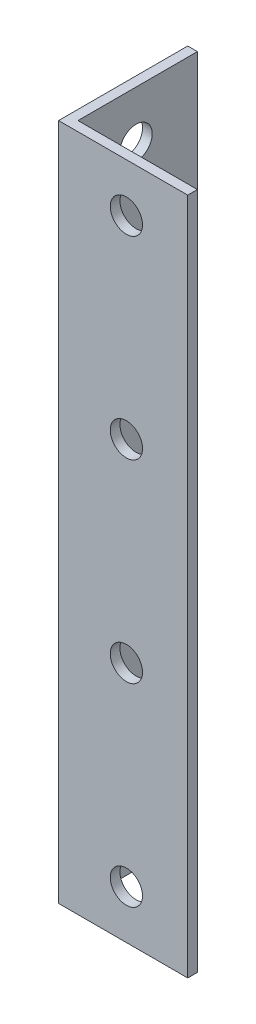
ISO-10303-21;
HEADER;
FILE_DESCRIPTION(('STEP AP214'),'2;1');
FILE_NAME('part.step','',(''),(''),'','','');
FILE_SCHEMA(('AUTOMOTIVE_DESIGN { 1 0 10303 214 1 1 1 1 }'));
ENDSEC;
DATA;
#1=APPLICATION_CONTEXT('core data for automotive mechanical design processes');
#2=APPLICATION_PROTOCOL_DEFINITION('international standard','automotive_design',2000,#1);
#3=PRODUCT_CONTEXT('',#1,'mechanical');
#4=PRODUCT('Part','Part','',(#3));
#5=PRODUCT_RELATED_PRODUCT_CATEGORY('part','',(#4));
#6=PRODUCT_DEFINITION_FORMATION('','',#4);
#7=PRODUCT_DEFINITION_CONTEXT('part definition',#1,'design');
#8=PRODUCT_DEFINITION('design','',#6,#7);
#9=PRODUCT_DEFINITION_SHAPE('','',#8);
#10=(LENGTH_UNIT() NAMED_UNIT(*) SI_UNIT(.MILLI.,.METRE.));
#11=(NAMED_UNIT(*) PLANE_ANGLE_UNIT() SI_UNIT($,.RADIAN.));
#12=(NAMED_UNIT(*) SI_UNIT($,.STERADIAN.) SOLID_ANGLE_UNIT());
#13=UNCERTAINTY_MEASURE_WITH_UNIT(LENGTH_MEASURE(1.E-05),#10,'distance_accuracy_value','');
#14=(GEOMETRIC_REPRESENTATION_CONTEXT(3) GLOBAL_UNCERTAINTY_ASSIGNED_CONTEXT((#13)) GLOBAL_UNIT_ASSIGNED_CONTEXT((#10,
#11,#12)) REPRESENTATION_CONTEXT('',''));
#15=CARTESIAN_POINT('',(0.,0.,0.));
#16=DIRECTION('',(0.,0.,1.));
#17=DIRECTION('',(1.,0.,0.));
#18=AXIS2_PLACEMENT_3D('',#15,#16,#17);
#19=CARTESIAN_POINT('',(0.,210.,0.));
#20=DIRECTION('',(0.,0.,-1.));
#21=DIRECTION('',(-1.,0.,0.));
#22=AXIS2_PLACEMENT_3D('',#19,#20,#21);
#23=PLANE('',#22);
#24=CARTESIAN_POINT('',(21.,15.,0.));
#25=DIRECTION('',(0.,0.,1.));
#26=DIRECTION('',(1.,0.,0.));
#27=AXIS2_PLACEMENT_3D('',#24,#25,#26);
#28=CIRCLE('',#27,5.);
#29=CARTESIAN_POINT('',(26.,15.,0.));
#30=VERTEX_POINT('',#29);
#31=EDGE_CURVE('E141',#30,#30,#28,.T.);
#32=ORIENTED_EDGE('',*,*,#31,.F.);
#33=EDGE_LOOP('',(#32));
#34=FACE_BOUND('',#33,.T.);
#35=CARTESIAN_POINT('',(20.9999999999996,135.,0.));
#36=DIRECTION('',(0.,0.,1.));
#37=DIRECTION('',(1.,0.,0.));
#38=AXIS2_PLACEMENT_3D('',#35,#36,#37);
#39=CIRCLE('',#38,4.99999999999999);
#40=CARTESIAN_POINT('',(25.9999999999996,135.,0.));
#41=VERTEX_POINT('',#40);
#42=EDGE_CURVE('E210',#41,#41,#39,.T.);
#43=ORIENTED_EDGE('',*,*,#42,.F.);
#44=EDGE_LOOP('',(#43));
#45=FACE_BOUND('',#44,.T.);
#46=CARTESIAN_POINT('',(20.9999999999994,195.,0.));
#47=DIRECTION('',(0.,0.,1.));
#48=DIRECTION('',(1.,0.,0.));
#49=AXIS2_PLACEMENT_3D('',#46,#47,#48);
#50=CIRCLE('',#49,4.99999999999999);
#51=CARTESIAN_POINT('',(25.9999999999994,195.,0.));
#52=VERTEX_POINT('',#51);
#53=EDGE_CURVE('E214',#52,#52,#50,.T.);
#54=ORIENTED_EDGE('',*,*,#53,.F.);
#55=EDGE_LOOP('',(#54));
#56=FACE_BOUND('',#55,.T.);
#57=CARTESIAN_POINT('',(20.9999999999998,75.,0.));
#58=DIRECTION('',(0.,0.,1.));
#59=DIRECTION('',(1.,0.,0.));
#60=AXIS2_PLACEMENT_3D('',#57,#58,#59);
#61=CIRCLE('',#60,5.);
#62=CARTESIAN_POINT('',(25.9999999999998,75.,0.));
#63=VERTEX_POINT('',#62);
#64=EDGE_CURVE('E217',#63,#63,#61,.T.);
#65=ORIENTED_EDGE('',*,*,#64,.F.);
#66=EDGE_LOOP('',(#65));
#67=FACE_BOUND('',#66,.T.);
#68=DIRECTION('',(1.,0.,0.));
#69=VECTOR('',#68,1.);
#70=CARTESIAN_POINT('',(0.,0.,0.));
#71=LINE('',#70,#69);
#72=CARTESIAN_POINT('',(0.,0.,0.));
#73=VERTEX_POINT('',#72);
#74=CARTESIAN_POINT('',(40.,0.,0.));
#75=VERTEX_POINT('',#74);
#76=EDGE_CURVE('E119',#73,#75,#71,.T.);
#77=ORIENTED_EDGE('',*,*,#76,.T.);
#78=DIRECTION('',(0.,-1.,0.));
#79=VECTOR('',#78,1.);
#80=CARTESIAN_POINT('',(40.,210.,0.));
#81=LINE('',#80,#79);
#82=CARTESIAN_POINT('',(40.,210.,0.));
#83=VERTEX_POINT('',#82);
#84=EDGE_CURVE('E11',#83,#75,#81,.T.);
#85=ORIENTED_EDGE('',*,*,#84,.F.);
#86=DIRECTION('',(1.,0.,0.));
#87=VECTOR('',#86,1.);
#88=CARTESIAN_POINT('',(0.,210.,0.));
#89=LINE('',#88,#87);
#90=CARTESIAN_POINT('',(0.,210.,0.));
#91=VERTEX_POINT('',#90);
#92=EDGE_CURVE('E84',#91,#83,#89,.T.);
#93=ORIENTED_EDGE('',*,*,#92,.F.);
#94=DIRECTION('',(0.,-1.,0.));
#95=VECTOR('',#94,1.);
#96=CARTESIAN_POINT('',(0.,210.,0.));
#97=LINE('',#96,#95);
#98=EDGE_CURVE('E115',#91,#73,#97,.T.);
#99=ORIENTED_EDGE('',*,*,#98,.T.);
#100=EDGE_LOOP('',(#77,#85,#93,#99));
#101=FACE_BOUND('',#100,.T.);
#102=ADVANCED_FACE('F36',(#34,#45,#56,#67,#101),#23,.F.);
#103=CARTESIAN_POINT('',(40.,210.,-3.));
#104=DIRECTION('',(1.,0.,0.));
#105=DIRECTION('',(0.,0.,-1.));
#106=AXIS2_PLACEMENT_3D('',#103,#104,#105);
#107=PLANE('',#106);
#108=DIRECTION('',(0.,0.,1.));
#109=VECTOR('',#108,1.);
#110=CARTESIAN_POINT('',(40.,0.,-3.));
#111=LINE('',#110,#109);
#112=CARTESIAN_POINT('',(40.,0.,-3.));
#113=VERTEX_POINT('',#112);
#114=EDGE_CURVE('E122',#113,#75,#111,.T.);
#115=ORIENTED_EDGE('',*,*,#114,.F.);
#116=DIRECTION('',(0.,-1.,0.));
#117=VECTOR('',#116,1.);
#118=CARTESIAN_POINT('',(40.,210.,-3.));
#119=LINE('',#118,#117);
#120=CARTESIAN_POINT('',(40.,210.,-3.));
#121=VERTEX_POINT('',#120);
#122=EDGE_CURVE('E45',#121,#113,#119,.T.);
#123=ORIENTED_EDGE('',*,*,#122,.F.);
#124=DIRECTION('',(0.,0.,1.));
#125=VECTOR('',#124,1.);
#126=CARTESIAN_POINT('',(40.,210.,-3.));
#127=LINE('',#126,#125);
#128=EDGE_CURVE('E174',#121,#83,#127,.T.);
#129=ORIENTED_EDGE('',*,*,#128,.T.);
#130=ORIENTED_EDGE('',*,*,#84,.T.);
#131=EDGE_LOOP('',(#115,#123,#129,#130));
#132=FACE_BOUND('',#131,.T.);
#133=ADVANCED_FACE('F198',(#132),#107,.T.);
#134=CARTESIAN_POINT('',(0.,210.,-3.));
#135=DIRECTION('',(0.,0.,-1.));
#136=DIRECTION('',(-1.,0.,0.));
#137=AXIS2_PLACEMENT_3D('',#134,#135,#136);
#138=PLANE('',#137);
#139=CARTESIAN_POINT('',(21.,15.,-3.));
#140=DIRECTION('',(0.,0.,-1.));
#141=DIRECTION('',(-1.,0.,0.));
#142=AXIS2_PLACEMENT_3D('',#139,#140,#141);
#143=CIRCLE('',#142,5.);
#144=CARTESIAN_POINT('',(16.,15.,-3.));
#145=VERTEX_POINT('',#144);
#146=EDGE_CURVE('E39',#145,#145,#143,.T.);
#147=ORIENTED_EDGE('',*,*,#146,.F.);
#148=EDGE_LOOP('',(#147));
#149=FACE_BOUND('',#148,.T.);
#150=CARTESIAN_POINT('',(20.9999999999996,135.,-3.));
#151=DIRECTION('',(0.,0.,-1.));
#152=DIRECTION('',(-1.,0.,0.));
#153=AXIS2_PLACEMENT_3D('',#150,#151,#152);
#154=CIRCLE('',#153,4.99999999999999);
#155=CARTESIAN_POINT('',(15.9999999999996,135.,-3.));
#156=VERTEX_POINT('',#155);
#157=EDGE_CURVE('E143',#156,#156,#154,.T.);
#158=ORIENTED_EDGE('',*,*,#157,.F.);
#159=EDGE_LOOP('',(#158));
#160=FACE_BOUND('',#159,.T.);
#161=CARTESIAN_POINT('',(20.9999999999994,195.,-3.));
#162=DIRECTION('',(0.,0.,-1.));
#163=DIRECTION('',(-1.,0.,0.));
#164=AXIS2_PLACEMENT_3D('',#161,#162,#163);
#165=CIRCLE('',#164,4.99999999999999);
#166=CARTESIAN_POINT('',(15.9999999999994,195.,-3.));
#167=VERTEX_POINT('',#166);
#168=EDGE_CURVE('E140',#167,#167,#165,.T.);
#169=ORIENTED_EDGE('',*,*,#168,.F.);
#170=EDGE_LOOP('',(#169));
#171=FACE_BOUND('',#170,.T.);
#172=CARTESIAN_POINT('',(20.9999999999998,75.,-3.));
#173=DIRECTION('',(0.,0.,-1.));
#174=DIRECTION('',(-1.,0.,0.));
#175=AXIS2_PLACEMENT_3D('',#172,#173,#174);
#176=CIRCLE('',#175,5.);
#177=CARTESIAN_POINT('',(15.9999999999998,75.,-3.));
#178=VERTEX_POINT('',#177);
#179=EDGE_CURVE('E137',#178,#178,#176,.T.);
#180=ORIENTED_EDGE('',*,*,#179,.F.);
#181=EDGE_LOOP('',(#180));
#182=FACE_BOUND('',#181,.T.);
#183=DIRECTION('',(1.,0.,0.));
#184=VECTOR('',#183,1.);
#185=CARTESIAN_POINT('',(0.,0.,-3.));
#186=LINE('',#185,#184);
#187=CARTESIAN_POINT('',(3.,0.,-3.));
#188=VERTEX_POINT('',#187);
#189=EDGE_CURVE('E126',#188,#113,#186,.T.);
#190=ORIENTED_EDGE('',*,*,#189,.F.);
#191=DIRECTION('',(0.,-1.,0.));
#192=VECTOR('',#191,1.);
#193=CARTESIAN_POINT('',(3.,210.,-3.));
#194=LINE('',#193,#192);
#195=CARTESIAN_POINT('',(3.,210.,-3.));
#196=VERTEX_POINT('',#195);
#197=EDGE_CURVE('E105',#196,#188,#194,.T.);
#198=ORIENTED_EDGE('',*,*,#197,.F.);
#199=DIRECTION('',(1.,0.,0.));
#200=VECTOR('',#199,1.);
#201=CARTESIAN_POINT('',(0.,210.,-3.));
#202=LINE('',#201,#200);
#203=EDGE_CURVE('E111',#196,#121,#202,.T.);
#204=ORIENTED_EDGE('',*,*,#203,.T.);
#205=ORIENTED_EDGE('',*,*,#122,.T.);
#206=EDGE_LOOP('',(#190,#198,#204,#205));
#207=FACE_BOUND('',#206,.T.);
#208=ADVANCED_FACE('F178',(#149,#160,#171,#182,#207),#138,.T.);
#209=CARTESIAN_POINT('',(3.,210.,-40.));
#210=DIRECTION('',(1.,0.,0.));
#211=DIRECTION('',(0.,0.,-1.));
#212=AXIS2_PLACEMENT_3D('',#209,#210,#211);
#213=PLANE('',#212);
#214=CARTESIAN_POINT('',(3.,15.,-21.));
#215=DIRECTION('',(1.,0.,0.));
#216=DIRECTION('',(0.,0.,-1.));
#217=AXIS2_PLACEMENT_3D('',#214,#215,#216);
#218=CIRCLE('',#217,5.);
#219=CARTESIAN_POINT('',(3.,15.,-26.));
#220=VERTEX_POINT('',#219);
#221=EDGE_CURVE('E123',#220,#220,#218,.T.);
#222=ORIENTED_EDGE('',*,*,#221,.F.);
#223=EDGE_LOOP('',(#222));
#224=FACE_BOUND('',#223,.T.);
#225=CARTESIAN_POINT('',(3.,75.,-21.));
#226=DIRECTION('',(1.,0.,0.));
#227=DIRECTION('',(0.,0.,-1.));
#228=AXIS2_PLACEMENT_3D('',#225,#226,#227);
#229=CIRCLE('',#228,5.);
#230=CARTESIAN_POINT('',(3.,75.,-26.));
#231=VERTEX_POINT('',#230);
#232=EDGE_CURVE('E168',#231,#231,#229,.T.);
#233=ORIENTED_EDGE('',*,*,#232,.F.);
#234=EDGE_LOOP('',(#233));
#235=FACE_BOUND('',#234,.T.);
#236=CARTESIAN_POINT('',(3.,135.,-21.));
#237=DIRECTION('',(1.,0.,0.));
#238=DIRECTION('',(0.,0.,-1.));
#239=AXIS2_PLACEMENT_3D('',#236,#237,#238);
#240=CIRCLE('',#239,4.99999999999999);
#241=CARTESIAN_POINT('',(3.,135.,-26.));
#242=VERTEX_POINT('',#241);
#243=EDGE_CURVE('E164',#242,#242,#240,.T.);
#244=ORIENTED_EDGE('',*,*,#243,.F.);
#245=EDGE_LOOP('',(#244));
#246=FACE_BOUND('',#245,.T.);
#247=CARTESIAN_POINT('',(3.,195.,-21.));
#248=DIRECTION('',(1.,0.,0.));
#249=DIRECTION('',(0.,0.,-1.));
#250=AXIS2_PLACEMENT_3D('',#247,#248,#249);
#251=CIRCLE('',#250,4.99999999999999);
#252=CARTESIAN_POINT('',(3.,195.,-26.));
#253=VERTEX_POINT('',#252);
#254=EDGE_CURVE('E161',#253,#253,#251,.T.);
#255=ORIENTED_EDGE('',*,*,#254,.F.);
#256=EDGE_LOOP('',(#255));
#257=FACE_BOUND('',#256,.T.);
#258=DIRECTION('',(0.,0.,-1.));
#259=VECTOR('',#258,1.);
#260=CARTESIAN_POINT('',(3.,0.,-40.));
#261=LINE('',#260,#259);
#262=CARTESIAN_POINT('',(3.,0.,-40.));
#263=VERTEX_POINT('',#262);
#264=EDGE_CURVE('E100',#263,#188,#261,.F.);
#265=ORIENTED_EDGE('',*,*,#264,.F.);
#266=DIRECTION('',(0.,-1.,0.));
#267=VECTOR('',#266,1.);
#268=CARTESIAN_POINT('',(3.,210.,-40.));
#269=LINE('',#268,#267);
#270=CARTESIAN_POINT('',(3.,210.,-40.));
#271=VERTEX_POINT('',#270);
#272=EDGE_CURVE('E95',#271,#263,#269,.T.);
#273=ORIENTED_EDGE('',*,*,#272,.F.);
#274=DIRECTION('',(0.,0.,-1.));
#275=VECTOR('',#274,1.);
#276=CARTESIAN_POINT('',(3.,210.,-40.));
#277=LINE('',#276,#275);
#278=EDGE_CURVE('E98',#271,#196,#277,.F.);
#279=ORIENTED_EDGE('',*,*,#278,.T.);
#280=ORIENTED_EDGE('',*,*,#197,.T.);
#281=EDGE_LOOP('',(#265,#273,#279,#280));
#282=FACE_BOUND('',#281,.T.);
#283=ADVANCED_FACE('F97',(#224,#235,#246,#257,#282),#213,.T.);
#284=CARTESIAN_POINT('',(0.,210.,-40.));
#285=DIRECTION('',(0.,0.,-1.));
#286=DIRECTION('',(-1.,0.,0.));
#287=AXIS2_PLACEMENT_3D('',#284,#285,#286);
#288=PLANE('',#287);
#289=DIRECTION('',(1.,0.,0.));
#290=VECTOR('',#289,1.);
#291=CARTESIAN_POINT('',(0.,0.,-40.));
#292=LINE('',#291,#290);
#293=CARTESIAN_POINT('',(0.,0.,-40.));
#294=VERTEX_POINT('',#293);
#295=EDGE_CURVE('E130',#294,#263,#292,.T.);
#296=ORIENTED_EDGE('',*,*,#295,.F.);
#297=DIRECTION('',(0.,-1.,0.));
#298=VECTOR('',#297,1.);
#299=CARTESIAN_POINT('',(0.,210.,-40.));
#300=LINE('',#299,#298);
#301=CARTESIAN_POINT('',(0.,210.,-40.));
#302=VERTEX_POINT('',#301);
#303=EDGE_CURVE('E75',#302,#294,#300,.T.);
#304=ORIENTED_EDGE('',*,*,#303,.F.);
#305=DIRECTION('',(1.,0.,0.));
#306=VECTOR('',#305,1.);
#307=CARTESIAN_POINT('',(0.,210.,-40.));
#308=LINE('',#307,#306);
#309=EDGE_CURVE('E109',#302,#271,#308,.T.);
#310=ORIENTED_EDGE('',*,*,#309,.T.);
#311=ORIENTED_EDGE('',*,*,#272,.T.);
#312=EDGE_LOOP('',(#296,#304,#310,#311));
#313=FACE_BOUND('',#312,.T.);
#314=ADVANCED_FACE('F113',(#313),#288,.T.);
#315=CARTESIAN_POINT('',(0.,210.,-40.));
#316=DIRECTION('',(1.,0.,0.));
#317=DIRECTION('',(0.,0.,-1.));
#318=AXIS2_PLACEMENT_3D('',#315,#316,#317);
#319=PLANE('',#318);
#320=CARTESIAN_POINT('',(0.,15.,-21.));
#321=DIRECTION('',(-1.,0.,0.));
#322=DIRECTION('',(0.,0.,1.));
#323=AXIS2_PLACEMENT_3D('',#320,#321,#322);
#324=CIRCLE('',#323,5.);
#325=CARTESIAN_POINT('',(0.,15.,-16.));
#326=VERTEX_POINT('',#325);
#327=EDGE_CURVE('E165',#326,#326,#324,.T.);
#328=ORIENTED_EDGE('',*,*,#327,.F.);
#329=EDGE_LOOP('',(#328));
#330=FACE_BOUND('',#329,.T.);
#331=CARTESIAN_POINT('',(0.,75.,-21.));
#332=DIRECTION('',(-1.,0.,0.));
#333=DIRECTION('',(0.,0.,1.));
#334=AXIS2_PLACEMENT_3D('',#331,#332,#333);
#335=CIRCLE('',#334,5.);
#336=CARTESIAN_POINT('',(0.,75.,-16.));
#337=VERTEX_POINT('',#336);
#338=EDGE_CURVE('E157',#337,#337,#335,.T.);
#339=ORIENTED_EDGE('',*,*,#338,.F.);
#340=EDGE_LOOP('',(#339));
#341=FACE_BOUND('',#340,.T.);
#342=CARTESIAN_POINT('',(0.,135.,-21.));
#343=DIRECTION('',(-1.,0.,0.));
#344=DIRECTION('',(0.,0.,1.));
#345=AXIS2_PLACEMENT_3D('',#342,#343,#344);
#346=CIRCLE('',#345,4.99999999999999);
#347=CARTESIAN_POINT('',(0.,135.,-16.));
#348=VERTEX_POINT('',#347);
#349=EDGE_CURVE('E152',#348,#348,#346,.T.);
#350=ORIENTED_EDGE('',*,*,#349,.F.);
#351=EDGE_LOOP('',(#350));
#352=FACE_BOUND('',#351,.T.);
#353=CARTESIAN_POINT('',(0.,195.,-21.));
#354=DIRECTION('',(-1.,0.,0.));
#355=DIRECTION('',(0.,0.,1.));
#356=AXIS2_PLACEMENT_3D('',#353,#354,#355);
#357=CIRCLE('',#356,4.99999999999999);
#358=CARTESIAN_POINT('',(0.,195.,-16.));
#359=VERTEX_POINT('',#358);
#360=EDGE_CURVE('E148',#359,#359,#357,.T.);
#361=ORIENTED_EDGE('',*,*,#360,.F.);
#362=EDGE_LOOP('',(#361));
#363=FACE_BOUND('',#362,.T.);
#364=DIRECTION('',(0.,0.,1.));
#365=VECTOR('',#364,1.);
#366=CARTESIAN_POINT('',(0.,0.,-40.));
#367=LINE('',#366,#365);
#368=EDGE_CURVE('E78',#294,#73,#367,.T.);
#369=ORIENTED_EDGE('',*,*,#368,.T.);
#370=ORIENTED_EDGE('',*,*,#98,.F.);
#371=DIRECTION('',(0.,0.,1.));
#372=VECTOR('',#371,1.);
#373=CARTESIAN_POINT('',(0.,210.,-40.));
#374=LINE('',#373,#372);
#375=EDGE_CURVE('E54',#302,#91,#374,.T.);
#376=ORIENTED_EDGE('',*,*,#375,.F.);
#377=ORIENTED_EDGE('',*,*,#303,.T.);
#378=EDGE_LOOP('',(#369,#370,#376,#377));
#379=FACE_BOUND('',#378,.T.);
#380=ADVANCED_FACE('F184',(#330,#341,#352,#363,#379),#319,.F.);
#381=CARTESIAN_POINT('',(0.,210.,0.));
#382=DIRECTION('',(0.,-1.,0.));
#383=DIRECTION('',(-1.,0.,0.));
#384=AXIS2_PLACEMENT_3D('',#381,#382,#383);
#385=PLANE('',#384);
#386=ORIENTED_EDGE('',*,*,#92,.T.);
#387=ORIENTED_EDGE('',*,*,#128,.F.);
#388=ORIENTED_EDGE('',*,*,#203,.F.);
#389=ORIENTED_EDGE('',*,*,#278,.F.);
#390=ORIENTED_EDGE('',*,*,#309,.F.);
#391=ORIENTED_EDGE('',*,*,#375,.T.);
#392=EDGE_LOOP('',(#386,#387,#388,#389,#390,#391));
#393=FACE_BOUND('',#392,.T.);
#394=ADVANCED_FACE('F108',(#393),#385,.F.);
#395=CARTESIAN_POINT('',(0.,0.,0.));
#396=DIRECTION('',(0.,-1.,0.));
#397=DIRECTION('',(-1.,0.,0.));
#398=AXIS2_PLACEMENT_3D('',#395,#396,#397);
#399=PLANE('',#398);
#400=ORIENTED_EDGE('',*,*,#76,.F.);
#401=ORIENTED_EDGE('',*,*,#368,.F.);
#402=ORIENTED_EDGE('',*,*,#295,.T.);
#403=ORIENTED_EDGE('',*,*,#264,.T.);
#404=ORIENTED_EDGE('',*,*,#189,.T.);
#405=ORIENTED_EDGE('',*,*,#114,.T.);
#406=EDGE_LOOP('',(#400,#401,#402,#403,#404,#405));
#407=FACE_BOUND('',#406,.T.);
#408=ADVANCED_FACE('F182',(#407),#399,.T.);
#409=CARTESIAN_POINT('',(40.,195.,-21.));
#410=DIRECTION('',(-1.,0.,0.));
#411=DIRECTION('',(0.,0.,1.));
#412=AXIS2_PLACEMENT_3D('',#409,#410,#411);
#413=CYLINDRICAL_SURFACE('',#412,4.99999999999999);
#414=ORIENTED_EDGE('',*,*,#254,.T.);
#415=EDGE_LOOP('',(#414));
#416=FACE_BOUND('',#415,.T.);
#417=ORIENTED_EDGE('',*,*,#360,.T.);
#418=EDGE_LOOP('',(#417));
#419=FACE_BOUND('',#418,.T.);
#420=ADVANCED_FACE('F234',(#416,#419),#413,.F.);
#421=CARTESIAN_POINT('',(40.,135.,-21.));
#422=DIRECTION('',(-1.,0.,0.));
#423=DIRECTION('',(0.,0.,1.));
#424=AXIS2_PLACEMENT_3D('',#421,#422,#423);
#425=CYLINDRICAL_SURFACE('',#424,4.99999999999999);
#426=ORIENTED_EDGE('',*,*,#243,.T.);
#427=EDGE_LOOP('',(#426));
#428=FACE_BOUND('',#427,.T.);
#429=ORIENTED_EDGE('',*,*,#349,.T.);
#430=EDGE_LOOP('',(#429));
#431=FACE_BOUND('',#430,.T.);
#432=ADVANCED_FACE('F232',(#428,#431),#425,.F.);
#433=CARTESIAN_POINT('',(40.,75.,-21.));
#434=DIRECTION('',(-1.,0.,0.));
#435=DIRECTION('',(0.,0.,1.));
#436=AXIS2_PLACEMENT_3D('',#433,#434,#435);
#437=CYLINDRICAL_SURFACE('',#436,5.);
#438=ORIENTED_EDGE('',*,*,#232,.T.);
#439=EDGE_LOOP('',(#438));
#440=FACE_BOUND('',#439,.T.);
#441=ORIENTED_EDGE('',*,*,#338,.T.);
#442=EDGE_LOOP('',(#441));
#443=FACE_BOUND('',#442,.T.);
#444=ADVANCED_FACE('F227',(#440,#443),#437,.F.);
#445=CARTESIAN_POINT('',(40.,15.,-21.));
#446=DIRECTION('',(-1.,0.,0.));
#447=DIRECTION('',(0.,0.,1.));
#448=AXIS2_PLACEMENT_3D('',#445,#446,#447);
#449=CYLINDRICAL_SURFACE('',#448,5.);
#450=ORIENTED_EDGE('',*,*,#221,.T.);
#451=EDGE_LOOP('',(#450));
#452=FACE_BOUND('',#451,.T.);
#453=ORIENTED_EDGE('',*,*,#327,.T.);
#454=EDGE_LOOP('',(#453));
#455=FACE_BOUND('',#454,.T.);
#456=ADVANCED_FACE('F241',(#452,#455),#449,.F.);
#457=CARTESIAN_POINT('',(20.9999999999998,75.,-40.));
#458=DIRECTION('',(0.,0.,1.));
#459=DIRECTION('',(1.,0.,0.));
#460=AXIS2_PLACEMENT_3D('',#457,#458,#459);
#461=CYLINDRICAL_SURFACE('',#460,5.);
#462=ORIENTED_EDGE('',*,*,#179,.T.);
#463=EDGE_LOOP('',(#462));
#464=FACE_BOUND('',#463,.T.);
#465=ORIENTED_EDGE('',*,*,#64,.T.);
#466=EDGE_LOOP('',(#465));
#467=FACE_BOUND('',#466,.T.);
#468=ADVANCED_FACE('F277',(#464,#467),#461,.F.);
#469=CARTESIAN_POINT('',(20.9999999999994,195.,-40.));
#470=DIRECTION('',(0.,0.,1.));
#471=DIRECTION('',(1.,0.,0.));
#472=AXIS2_PLACEMENT_3D('',#469,#470,#471);
#473=CYLINDRICAL_SURFACE('',#472,4.99999999999999);
#474=ORIENTED_EDGE('',*,*,#168,.T.);
#475=EDGE_LOOP('',(#474));
#476=FACE_BOUND('',#475,.T.);
#477=ORIENTED_EDGE('',*,*,#53,.T.);
#478=EDGE_LOOP('',(#477));
#479=FACE_BOUND('',#478,.T.);
#480=ADVANCED_FACE('F303',(#476,#479),#473,.F.);
#481=CARTESIAN_POINT('',(20.9999999999996,135.,-40.));
#482=DIRECTION('',(0.,0.,1.));
#483=DIRECTION('',(1.,0.,0.));
#484=AXIS2_PLACEMENT_3D('',#481,#482,#483);
#485=CYLINDRICAL_SURFACE('',#484,4.99999999999999);
#486=ORIENTED_EDGE('',*,*,#157,.T.);
#487=EDGE_LOOP('',(#486));
#488=FACE_BOUND('',#487,.T.);
#489=ORIENTED_EDGE('',*,*,#42,.T.);
#490=EDGE_LOOP('',(#489));
#491=FACE_BOUND('',#490,.T.);
#492=ADVANCED_FACE('F313',(#488,#491),#485,.F.);
#493=CARTESIAN_POINT('',(21.,15.,-40.));
#494=DIRECTION('',(0.,0.,1.));
#495=DIRECTION('',(1.,0.,0.));
#496=AXIS2_PLACEMENT_3D('',#493,#494,#495);
#497=CYLINDRICAL_SURFACE('',#496,5.);
#498=ORIENTED_EDGE('',*,*,#146,.T.);
#499=EDGE_LOOP('',(#498));
#500=FACE_BOUND('',#499,.T.);
#501=ORIENTED_EDGE('',*,*,#31,.T.);
#502=EDGE_LOOP('',(#501));
#503=FACE_BOUND('',#502,.T.);
#504=ADVANCED_FACE('F323',(#500,#503),#497,.F.);
#505=CLOSED_SHELL('',(#102,#133,#208,#283,#314,#380,#394,#408,#420,#432,#444,#456,#468,#480,
#492,#504));
#506=MANIFOLD_SOLID_BREP('B2',#505);
#507=ADVANCED_BREP_SHAPE_REPRESENTATION('',(#18,#506),#14);
#508=SHAPE_DEFINITION_REPRESENTATION(#9,#507);
ENDSEC;
END-ISO-10303-21;
